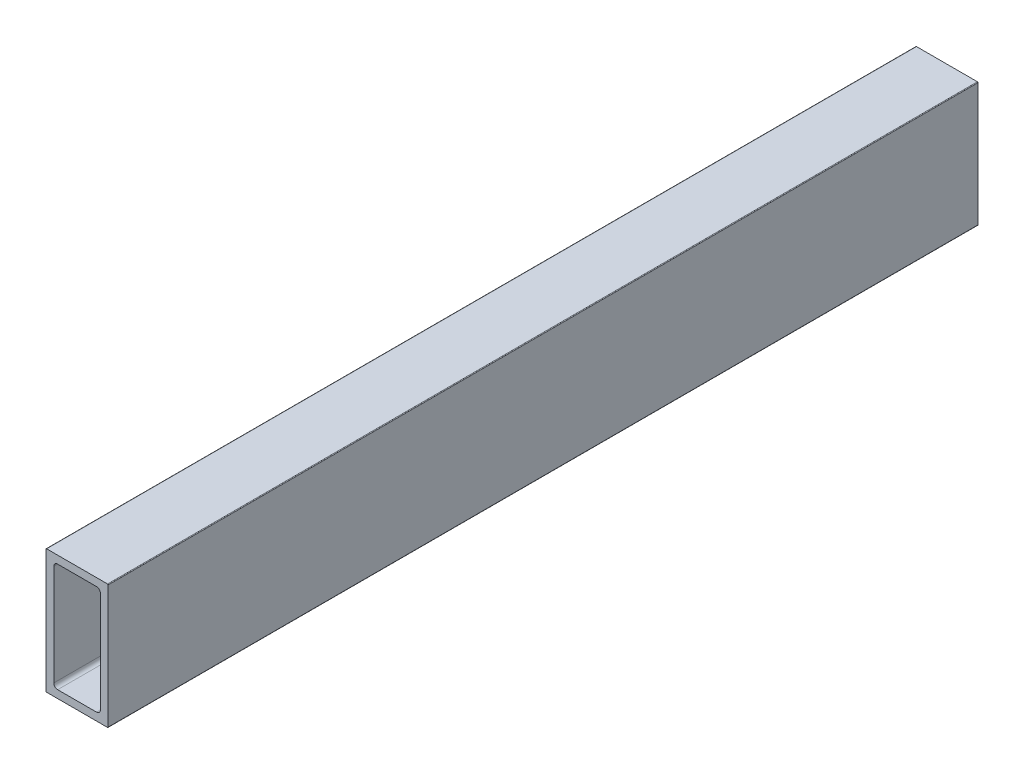
ISO-10303-21;
HEADER;
FILE_DESCRIPTION(('STEP AP214'),'2;1');
FILE_NAME('part.step','',(''),(''),'','','');
FILE_SCHEMA(('AUTOMOTIVE_DESIGN { 1 0 10303 214 1 1 1 1 }'));
ENDSEC;
DATA;
#1=APPLICATION_CONTEXT('core data for automotive mechanical design processes');
#2=APPLICATION_PROTOCOL_DEFINITION('international standard','automotive_design',2000,#1);
#3=PRODUCT_CONTEXT('',#1,'mechanical');
#4=PRODUCT('Part','Part','',(#3));
#5=PRODUCT_RELATED_PRODUCT_CATEGORY('part','',(#4));
#6=PRODUCT_DEFINITION_FORMATION('','',#4);
#7=PRODUCT_DEFINITION_CONTEXT('part definition',#1,'design');
#8=PRODUCT_DEFINITION('design','',#6,#7);
#9=PRODUCT_DEFINITION_SHAPE('','',#8);
#10=(LENGTH_UNIT() NAMED_UNIT(*) SI_UNIT(.MILLI.,.METRE.));
#11=(NAMED_UNIT(*) PLANE_ANGLE_UNIT() SI_UNIT($,.RADIAN.));
#12=(NAMED_UNIT(*) SI_UNIT($,.STERADIAN.) SOLID_ANGLE_UNIT());
#13=UNCERTAINTY_MEASURE_WITH_UNIT(LENGTH_MEASURE(1.E-05),#10,'distance_accuracy_value','');
#14=(GEOMETRIC_REPRESENTATION_CONTEXT(3) GLOBAL_UNCERTAINTY_ASSIGNED_CONTEXT((#13)) GLOBAL_UNIT_ASSIGNED_CONTEXT((#10,
#11,#12)) REPRESENTATION_CONTEXT('',''));
#15=CARTESIAN_POINT('',(0.,0.,0.));
#16=DIRECTION('',(0.,0.,1.));
#17=DIRECTION('',(1.,0.,0.));
#18=AXIS2_PLACEMENT_3D('',#15,#16,#17);
#19=CARTESIAN_POINT('',(3.175,4.7625,1828.8));
#20=DIRECTION('',(1.,0.,0.));
#21=DIRECTION('',(0.,1.,0.));
#22=AXIS2_PLACEMENT_3D('',#19,#20,#21);
#23=PLANE('',#22);
#24=DIRECTION('',(0.,-1.,0.));
#25=VECTOR('',#24,1.);
#26=CARTESIAN_POINT('',(3.175,4.7625,1473.2));
#27=LINE('',#26,#25);
#28=CARTESIAN_POINT('',(3.175,46.0375,1473.2));
#29=VERTEX_POINT('',#28);
#30=CARTESIAN_POINT('',(3.175,4.7625,1473.2));
#31=VERTEX_POINT('',#30);
#32=EDGE_CURVE('E59',#29,#31,#27,.T.);
#33=ORIENTED_EDGE('',*,*,#32,.F.);
#34=DIRECTION('',(0.,0.,-1.));
#35=VECTOR('',#34,1.);
#36=CARTESIAN_POINT('',(3.175,46.0375,1828.8));
#37=LINE('',#36,#35);
#38=CARTESIAN_POINT('',(3.175,46.0375,1828.8));
#39=VERTEX_POINT('',#38);
#40=EDGE_CURVE('E52',#39,#29,#37,.T.);
#41=ORIENTED_EDGE('',*,*,#40,.F.);
#42=DIRECTION('',(0.,-1.,0.));
#43=VECTOR('',#42,1.);
#44=CARTESIAN_POINT('',(3.175,4.7625,1828.8));
#45=LINE('',#44,#43);
#46=CARTESIAN_POINT('',(3.175,4.7625,1828.8));
#47=VERTEX_POINT('',#46);
#48=EDGE_CURVE('E235',#39,#47,#45,.T.);
#49=ORIENTED_EDGE('',*,*,#48,.T.);
#50=DIRECTION('',(0.,0.,-1.));
#51=VECTOR('',#50,1.);
#52=CARTESIAN_POINT('',(3.175,4.7625,1828.8));
#53=LINE('',#52,#51);
#54=EDGE_CURVE('E304',#47,#31,#53,.T.);
#55=ORIENTED_EDGE('',*,*,#54,.T.);
#56=EDGE_LOOP('',(#33,#41,#49,#55));
#57=FACE_BOUND('',#56,.T.);
#58=ADVANCED_FACE('F44',(#57),#23,.T.);
#59=CARTESIAN_POINT('',(4.7625,46.0375,1828.8));
#60=DIRECTION('',(0.,0.,-1.));
#61=DIRECTION('',(-1.,0.,0.));
#62=AXIS2_PLACEMENT_3D('',#59,#60,#61);
#63=CYLINDRICAL_SURFACE('',#62,1.5875);
#64=ORIENTED_EDGE('',*,*,#40,.T.);
#65=CARTESIAN_POINT('',(4.7625,46.0375,1473.2));
#66=DIRECTION('',(0.,0.,1.));
#67=DIRECTION('',(1.,0.,0.));
#68=AXIS2_PLACEMENT_3D('',#65,#66,#67);
#69=CIRCLE('',#68,1.5875);
#70=CARTESIAN_POINT('',(4.7625,47.625,1473.2));
#71=VERTEX_POINT('',#70);
#72=EDGE_CURVE('E350',#29,#71,#69,.F.);
#73=ORIENTED_EDGE('',*,*,#72,.T.);
#74=DIRECTION('',(0.,0.,-1.));
#75=VECTOR('',#74,1.);
#76=CARTESIAN_POINT('',(4.7625,47.625,1828.8));
#77=LINE('',#76,#75);
#78=CARTESIAN_POINT('',(4.7625,47.625,1828.8));
#79=VERTEX_POINT('',#78);
#80=EDGE_CURVE('E213',#79,#71,#77,.T.);
#81=ORIENTED_EDGE('',*,*,#80,.F.);
#82=CARTESIAN_POINT('',(4.7625,46.0375,1828.8));
#83=DIRECTION('',(0.,0.,1.));
#84=DIRECTION('',(-1.,0.,0.));
#85=AXIS2_PLACEMENT_3D('',#82,#83,#84);
#86=CIRCLE('',#85,1.5875);
#87=EDGE_CURVE('E239',#79,#39,#86,.T.);
#88=ORIENTED_EDGE('',*,*,#87,.T.);
#89=EDGE_LOOP('',(#64,#73,#81,#88));
#90=FACE_BOUND('',#89,.T.);
#91=ADVANCED_FACE('F353',(#90),#63,.F.);
#92=CARTESIAN_POINT('',(4.7625,47.625,1828.8));
#93=DIRECTION('',(0.,-1.,0.));
#94=DIRECTION('',(0.,0.,-1.));
#95=AXIS2_PLACEMENT_3D('',#92,#93,#94);
#96=PLANE('',#95);
#97=DIRECTION('',(-1.,0.,0.));
#98=VECTOR('',#97,1.);
#99=CARTESIAN_POINT('',(4.7625,47.625,1473.2));
#100=LINE('',#99,#98);
#101=CARTESIAN_POINT('',(20.6375,47.625,1473.2));
#102=VERTEX_POINT('',#101);
#103=EDGE_CURVE('E348',#102,#71,#100,.T.);
#104=ORIENTED_EDGE('',*,*,#103,.F.);
#105=DIRECTION('',(0.,0.,-1.));
#106=VECTOR('',#105,1.);
#107=CARTESIAN_POINT('',(20.6375,47.625,1828.8));
#108=LINE('',#107,#106);
#109=CARTESIAN_POINT('',(20.6375,47.625,1828.8));
#110=VERTEX_POINT('',#109);
#111=EDGE_CURVE('E210',#110,#102,#108,.T.);
#112=ORIENTED_EDGE('',*,*,#111,.F.);
#113=DIRECTION('',(-1.,0.,0.));
#114=VECTOR('',#113,1.);
#115=CARTESIAN_POINT('',(4.7625,47.625,1828.8));
#116=LINE('',#115,#114);
#117=EDGE_CURVE('E259',#110,#79,#116,.T.);
#118=ORIENTED_EDGE('',*,*,#117,.T.);
#119=ORIENTED_EDGE('',*,*,#80,.T.);
#120=EDGE_LOOP('',(#104,#112,#118,#119));
#121=FACE_BOUND('',#120,.T.);
#122=ADVANCED_FACE('F355',(#121),#96,.T.);
#123=CARTESIAN_POINT('',(20.6375,46.0375,1828.8));
#124=DIRECTION('',(0.,0.,-1.));
#125=DIRECTION('',(-1.,0.,0.));
#126=AXIS2_PLACEMENT_3D('',#123,#124,#125);
#127=CYLINDRICAL_SURFACE('',#126,1.5875);
#128=ORIENTED_EDGE('',*,*,#111,.T.);
#129=CARTESIAN_POINT('',(20.6375,46.0375,1473.2));
#130=DIRECTION('',(0.,0.,1.));
#131=DIRECTION('',(1.,0.,0.));
#132=AXIS2_PLACEMENT_3D('',#129,#130,#131);
#133=CIRCLE('',#132,1.5875);
#134=CARTESIAN_POINT('',(22.225,46.0375,1473.2));
#135=VERTEX_POINT('',#134);
#136=EDGE_CURVE('E345',#102,#135,#133,.F.);
#137=ORIENTED_EDGE('',*,*,#136,.T.);
#138=DIRECTION('',(0.,0.,-1.));
#139=VECTOR('',#138,1.);
#140=CARTESIAN_POINT('',(22.225,46.0375,1828.8));
#141=LINE('',#140,#139);
#142=CARTESIAN_POINT('',(22.225,46.0375,1828.8));
#143=VERTEX_POINT('',#142);
#144=EDGE_CURVE('E214',#143,#135,#141,.T.);
#145=ORIENTED_EDGE('',*,*,#144,.F.);
#146=CARTESIAN_POINT('',(20.6375,46.0375,1828.8));
#147=DIRECTION('',(0.,0.,1.));
#148=DIRECTION('',(-1.,0.,0.));
#149=AXIS2_PLACEMENT_3D('',#146,#147,#148);
#150=CIRCLE('',#149,1.5875);
#151=EDGE_CURVE('E256',#143,#110,#150,.T.);
#152=ORIENTED_EDGE('',*,*,#151,.T.);
#153=EDGE_LOOP('',(#128,#137,#145,#152));
#154=FACE_BOUND('',#153,.T.);
#155=ADVANCED_FACE('F356',(#154),#127,.F.);
#156=CARTESIAN_POINT('',(22.225,4.7625,1828.8));
#157=DIRECTION('',(-1.,0.,0.));
#158=DIRECTION('',(0.,0.,1.));
#159=AXIS2_PLACEMENT_3D('',#156,#157,#158);
#160=PLANE('',#159);
#161=DIRECTION('',(0.,1.,0.));
#162=VECTOR('',#161,1.);
#163=CARTESIAN_POINT('',(22.225,4.7625,1473.2));
#164=LINE('',#163,#162);
#165=CARTESIAN_POINT('',(22.225,4.7625,1473.2));
#166=VERTEX_POINT('',#165);
#167=EDGE_CURVE('E343',#166,#135,#164,.T.);
#168=ORIENTED_EDGE('',*,*,#167,.F.);
#169=DIRECTION('',(0.,0.,-1.));
#170=VECTOR('',#169,1.);
#171=CARTESIAN_POINT('',(22.225,4.7625,1828.8));
#172=LINE('',#171,#170);
#173=CARTESIAN_POINT('',(22.225,4.7625,1828.8));
#174=VERTEX_POINT('',#173);
#175=EDGE_CURVE('E295',#174,#166,#172,.T.);
#176=ORIENTED_EDGE('',*,*,#175,.F.);
#177=DIRECTION('',(0.,1.,0.));
#178=VECTOR('',#177,1.);
#179=CARTESIAN_POINT('',(22.225,4.7625,1828.8));
#180=LINE('',#179,#178);
#181=EDGE_CURVE('E252',#174,#143,#180,.T.);
#182=ORIENTED_EDGE('',*,*,#181,.T.);
#183=ORIENTED_EDGE('',*,*,#144,.T.);
#184=EDGE_LOOP('',(#168,#176,#182,#183));
#185=FACE_BOUND('',#184,.T.);
#186=ADVANCED_FACE('F359',(#185),#160,.T.);
#187=CARTESIAN_POINT('',(20.6375,4.7625,1828.8));
#188=DIRECTION('',(0.,0.,-1.));
#189=DIRECTION('',(-1.,0.,0.));
#190=AXIS2_PLACEMENT_3D('',#187,#188,#189);
#191=CYLINDRICAL_SURFACE('',#190,1.5875);
#192=ORIENTED_EDGE('',*,*,#175,.T.);
#193=CARTESIAN_POINT('',(20.6375,4.7625,1473.2));
#194=DIRECTION('',(0.,0.,1.));
#195=DIRECTION('',(1.,0.,0.));
#196=AXIS2_PLACEMENT_3D('',#193,#194,#195);
#197=CIRCLE('',#196,1.5875);
#198=CARTESIAN_POINT('',(20.6375,3.175,1473.2));
#199=VERTEX_POINT('',#198);
#200=EDGE_CURVE('E340',#166,#199,#197,.F.);
#201=ORIENTED_EDGE('',*,*,#200,.T.);
#202=DIRECTION('',(0.,0.,-1.));
#203=VECTOR('',#202,1.);
#204=CARTESIAN_POINT('',(20.6375,3.175,1828.8));
#205=LINE('',#204,#203);
#206=CARTESIAN_POINT('',(20.6375,3.175,1828.8));
#207=VERTEX_POINT('',#206);
#208=EDGE_CURVE('E208',#207,#199,#205,.T.);
#209=ORIENTED_EDGE('',*,*,#208,.F.);
#210=CARTESIAN_POINT('',(20.6375,4.7625,1828.8));
#211=DIRECTION('',(0.,0.,1.));
#212=DIRECTION('',(-1.,0.,0.));
#213=AXIS2_PLACEMENT_3D('',#210,#211,#212);
#214=CIRCLE('',#213,1.5875);
#215=EDGE_CURVE('E255',#207,#174,#214,.T.);
#216=ORIENTED_EDGE('',*,*,#215,.T.);
#217=EDGE_LOOP('',(#192,#201,#209,#216));
#218=FACE_BOUND('',#217,.T.);
#219=ADVANCED_FACE('F377',(#218),#191,.F.);
#220=CARTESIAN_POINT('',(4.7625,3.175,1828.8));
#221=DIRECTION('',(0.,1.,0.));
#222=DIRECTION('',(1.,0.,0.));
#223=AXIS2_PLACEMENT_3D('',#220,#221,#222);
#224=PLANE('',#223);
#225=DIRECTION('',(1.,0.,0.));
#226=VECTOR('',#225,1.);
#227=CARTESIAN_POINT('',(4.7625,3.175,1473.2));
#228=LINE('',#227,#226);
#229=CARTESIAN_POINT('',(4.7625,3.175,1473.2));
#230=VERTEX_POINT('',#229);
#231=EDGE_CURVE('E338',#230,#199,#228,.T.);
#232=ORIENTED_EDGE('',*,*,#231,.F.);
#233=DIRECTION('',(0.,0.,-1.));
#234=VECTOR('',#233,1.);
#235=CARTESIAN_POINT('',(4.7625,3.175,1828.8));
#236=LINE('',#235,#234);
#237=CARTESIAN_POINT('',(4.7625,3.175,1828.8));
#238=VERTEX_POINT('',#237);
#239=EDGE_CURVE('E313',#238,#230,#236,.T.);
#240=ORIENTED_EDGE('',*,*,#239,.F.);
#241=DIRECTION('',(1.,0.,0.));
#242=VECTOR('',#241,1.);
#243=CARTESIAN_POINT('',(4.7625,3.175,1828.8));
#244=LINE('',#243,#242);
#245=EDGE_CURVE('E248',#238,#207,#244,.T.);
#246=ORIENTED_EDGE('',*,*,#245,.T.);
#247=ORIENTED_EDGE('',*,*,#208,.T.);
#248=EDGE_LOOP('',(#232,#240,#246,#247));
#249=FACE_BOUND('',#248,.T.);
#250=ADVANCED_FACE('F374',(#249),#224,.T.);
#251=CARTESIAN_POINT('',(4.7625,4.7625,1828.8));
#252=DIRECTION('',(0.,0.,-1.));
#253=DIRECTION('',(-1.,0.,0.));
#254=AXIS2_PLACEMENT_3D('',#251,#252,#253);
#255=CYLINDRICAL_SURFACE('',#254,1.5875);
#256=ORIENTED_EDGE('',*,*,#239,.T.);
#257=CARTESIAN_POINT('',(4.7625,4.7625,1473.2));
#258=DIRECTION('',(0.,0.,1.));
#259=DIRECTION('',(1.,0.,0.));
#260=AXIS2_PLACEMENT_3D('',#257,#258,#259);
#261=CIRCLE('',#260,1.5875);
#262=EDGE_CURVE('E180',#230,#31,#261,.F.);
#263=ORIENTED_EDGE('',*,*,#262,.T.);
#264=ORIENTED_EDGE('',*,*,#54,.F.);
#265=CARTESIAN_POINT('',(4.7625,4.7625,1828.8));
#266=DIRECTION('',(0.,0.,1.));
#267=DIRECTION('',(1.,0.,0.));
#268=AXIS2_PLACEMENT_3D('',#265,#266,#267);
#269=CIRCLE('',#268,1.5875);
#270=EDGE_CURVE('E219',#47,#238,#269,.T.);
#271=ORIENTED_EDGE('',*,*,#270,.T.);
#272=EDGE_LOOP('',(#256,#263,#264,#271));
#273=FACE_BOUND('',#272,.T.);
#274=ADVANCED_FACE('F370',(#273),#255,.F.);
#275=CARTESIAN_POINT('',(0.,0.254,1828.8));
#276=DIRECTION('',(1.,0.,0.));
#277=DIRECTION('',(0.,1.,0.));
#278=AXIS2_PLACEMENT_3D('',#275,#276,#277);
#279=PLANE('',#278);
#280=DIRECTION('',(0.,0.,-1.));
#281=VECTOR('',#280,1.);
#282=CARTESIAN_POINT('',(0.,50.546,1828.8));
#283=LINE('',#282,#281);
#284=CARTESIAN_POINT('',(0.,50.546,1828.8));
#285=VERTEX_POINT('',#284);
#286=CARTESIAN_POINT('',(0.,50.546,1473.2));
#287=VERTEX_POINT('',#286);
#288=EDGE_CURVE('E223',#285,#287,#283,.T.);
#289=ORIENTED_EDGE('',*,*,#288,.T.);
#290=DIRECTION('',(0.,-1.,0.));
#291=VECTOR('',#290,1.);
#292=CARTESIAN_POINT('',(0.,0.254,1473.2));
#293=LINE('',#292,#291);
#294=CARTESIAN_POINT('',(0.,0.254,1473.2));
#295=VERTEX_POINT('',#294);
#296=EDGE_CURVE('E329',#287,#295,#293,.T.);
#297=ORIENTED_EDGE('',*,*,#296,.T.);
#298=DIRECTION('',(0.,0.,-1.));
#299=VECTOR('',#298,1.);
#300=CARTESIAN_POINT('',(0.,0.254,1828.8));
#301=LINE('',#300,#299);
#302=CARTESIAN_POINT('',(0.,0.254,1828.8));
#303=VERTEX_POINT('',#302);
#304=EDGE_CURVE('E230',#303,#295,#301,.T.);
#305=ORIENTED_EDGE('',*,*,#304,.F.);
#306=DIRECTION('',(0.,-1.,0.));
#307=VECTOR('',#306,1.);
#308=CARTESIAN_POINT('',(0.,0.254,1828.8));
#309=LINE('',#308,#307);
#310=EDGE_CURVE('E215',#285,#303,#309,.T.);
#311=ORIENTED_EDGE('',*,*,#310,.F.);
#312=EDGE_LOOP('',(#289,#297,#305,#311));
#313=FACE_BOUND('',#312,.T.);
#314=ADVANCED_FACE('F46',(#313),#279,.F.);
#315=CARTESIAN_POINT('',(0.254,50.546,1828.8));
#316=DIRECTION('',(0.,0.,-1.));
#317=DIRECTION('',(-1.,0.,0.));
#318=AXIS2_PLACEMENT_3D('',#315,#316,#317);
#319=CYLINDRICAL_SURFACE('',#318,0.253999999999995);
#320=CARTESIAN_POINT('',(0.254,50.546,1473.2));
#321=DIRECTION('',(0.,0.,1.));
#322=DIRECTION('',(1.,0.,0.));
#323=AXIS2_PLACEMENT_3D('',#320,#321,#322);
#324=CIRCLE('',#323,0.253999999999995);
#325=CARTESIAN_POINT('',(0.254,50.8,1473.2));
#326=VERTEX_POINT('',#325);
#327=EDGE_CURVE('E334',#287,#326,#324,.F.);
#328=ORIENTED_EDGE('',*,*,#327,.F.);
#329=ORIENTED_EDGE('',*,*,#288,.F.);
#330=CARTESIAN_POINT('',(0.254,50.546,1828.8));
#331=DIRECTION('',(0.,0.,1.));
#332=DIRECTION('',(-1.,0.,0.));
#333=AXIS2_PLACEMENT_3D('',#330,#331,#332);
#334=CIRCLE('',#333,0.253999999999995);
#335=CARTESIAN_POINT('',(0.254,50.8,1828.8));
#336=VERTEX_POINT('',#335);
#337=EDGE_CURVE('E220',#336,#285,#334,.T.);
#338=ORIENTED_EDGE('',*,*,#337,.F.);
#339=DIRECTION('',(0.,0.,-1.));
#340=VECTOR('',#339,1.);
#341=CARTESIAN_POINT('',(0.254,50.8,1828.8));
#342=LINE('',#341,#340);
#343=EDGE_CURVE('E201',#336,#326,#342,.T.);
#344=ORIENTED_EDGE('',*,*,#343,.T.);
#345=EDGE_LOOP('',(#328,#329,#338,#344));
#346=FACE_BOUND('',#345,.T.);
#347=ADVANCED_FACE('F410',(#346),#319,.T.);
#348=CARTESIAN_POINT('',(0.254,50.8,1828.8));
#349=DIRECTION('',(0.,-1.,0.));
#350=DIRECTION('',(0.,0.,-1.));
#351=AXIS2_PLACEMENT_3D('',#348,#349,#350);
#352=PLANE('',#351);
#353=DIRECTION('',(0.,0.,-1.));
#354=VECTOR('',#353,1.);
#355=CARTESIAN_POINT('',(25.146,50.8,1828.8));
#356=LINE('',#355,#354);
#357=CARTESIAN_POINT('',(25.146,50.8,1828.8));
#358=VERTEX_POINT('',#357);
#359=CARTESIAN_POINT('',(25.146,50.8,1473.2));
#360=VERTEX_POINT('',#359);
#361=EDGE_CURVE('E195',#358,#360,#356,.T.);
#362=ORIENTED_EDGE('',*,*,#361,.T.);
#363=DIRECTION('',(-1.,0.,0.));
#364=VECTOR('',#363,1.);
#365=CARTESIAN_POINT('',(0.254,50.8,1473.2));
#366=LINE('',#365,#364);
#367=EDGE_CURVE('E176',#360,#326,#366,.T.);
#368=ORIENTED_EDGE('',*,*,#367,.T.);
#369=ORIENTED_EDGE('',*,*,#343,.F.);
#370=DIRECTION('',(-1.,0.,0.));
#371=VECTOR('',#370,1.);
#372=CARTESIAN_POINT('',(0.254,50.8,1828.8));
#373=LINE('',#372,#371);
#374=EDGE_CURVE('E280',#358,#336,#373,.T.);
#375=ORIENTED_EDGE('',*,*,#374,.F.);
#376=EDGE_LOOP('',(#362,#368,#369,#375));
#377=FACE_BOUND('',#376,.T.);
#378=ADVANCED_FACE('F407',(#377),#352,.F.);
#379=CARTESIAN_POINT('',(25.146,50.546,1828.8));
#380=DIRECTION('',(0.,0.,-1.));
#381=DIRECTION('',(-1.,0.,0.));
#382=AXIS2_PLACEMENT_3D('',#379,#380,#381);
#383=CYLINDRICAL_SURFACE('',#382,0.253999999999994);
#384=CARTESIAN_POINT('',(25.146,50.546,1473.2));
#385=DIRECTION('',(0.,0.,1.));
#386=DIRECTION('',(1.,0.,0.));
#387=AXIS2_PLACEMENT_3D('',#384,#385,#386);
#388=CIRCLE('',#387,0.253999999999994);
#389=CARTESIAN_POINT('',(25.4,50.546,1473.2));
#390=VERTEX_POINT('',#389);
#391=EDGE_CURVE('E170',#360,#390,#388,.F.);
#392=ORIENTED_EDGE('',*,*,#391,.F.);
#393=ORIENTED_EDGE('',*,*,#361,.F.);
#394=CARTESIAN_POINT('',(25.146,50.546,1828.8));
#395=DIRECTION('',(0.,0.,1.));
#396=DIRECTION('',(-1.,0.,0.));
#397=AXIS2_PLACEMENT_3D('',#394,#395,#396);
#398=CIRCLE('',#397,0.253999999999994);
#399=CARTESIAN_POINT('',(25.4,50.546,1828.8));
#400=VERTEX_POINT('',#399);
#401=EDGE_CURVE('E192',#400,#358,#398,.T.);
#402=ORIENTED_EDGE('',*,*,#401,.F.);
#403=DIRECTION('',(0.,0.,-1.));
#404=VECTOR('',#403,1.);
#405=CARTESIAN_POINT('',(25.4,50.546,1828.8));
#406=LINE('',#405,#404);
#407=EDGE_CURVE('E186',#400,#390,#406,.T.);
#408=ORIENTED_EDGE('',*,*,#407,.T.);
#409=EDGE_LOOP('',(#392,#393,#402,#408));
#410=FACE_BOUND('',#409,.T.);
#411=ADVANCED_FACE('F190',(#410),#383,.T.);
#412=CARTESIAN_POINT('',(25.4,0.254,1828.8));
#413=DIRECTION('',(-1.,0.,0.));
#414=DIRECTION('',(0.,0.,1.));
#415=AXIS2_PLACEMENT_3D('',#412,#413,#414);
#416=PLANE('',#415);
#417=DIRECTION('',(0.,0.,-1.));
#418=VECTOR('',#417,1.);
#419=CARTESIAN_POINT('',(25.4,0.254,1828.8));
#420=LINE('',#419,#418);
#421=CARTESIAN_POINT('',(25.4,0.254,1828.8));
#422=VERTEX_POINT('',#421);
#423=CARTESIAN_POINT('',(25.4,0.254,1473.2));
#424=VERTEX_POINT('',#423);
#425=EDGE_CURVE('E188',#422,#424,#420,.T.);
#426=ORIENTED_EDGE('',*,*,#425,.T.);
#427=DIRECTION('',(0.,-1.,0.));
#428=VECTOR('',#427,1.);
#429=CARTESIAN_POINT('',(25.4,0.,1473.2));
#430=LINE('',#429,#428);
#431=EDGE_CURVE('E173',#390,#424,#430,.T.);
#432=ORIENTED_EDGE('',*,*,#431,.F.);
#433=ORIENTED_EDGE('',*,*,#407,.F.);
#434=DIRECTION('',(0.,1.,0.));
#435=VECTOR('',#434,1.);
#436=CARTESIAN_POINT('',(25.4,0.254,1828.8));
#437=LINE('',#436,#435);
#438=EDGE_CURVE('E244',#422,#400,#437,.T.);
#439=ORIENTED_EDGE('',*,*,#438,.F.);
#440=EDGE_LOOP('',(#426,#432,#433,#439));
#441=FACE_BOUND('',#440,.T.);
#442=ADVANCED_FACE('F184',(#441),#416,.F.);
#443=CARTESIAN_POINT('',(25.146,0.254,1828.8));
#444=DIRECTION('',(0.,0.,-1.));
#445=DIRECTION('',(-1.,0.,0.));
#446=AXIS2_PLACEMENT_3D('',#443,#444,#445);
#447=CYLINDRICAL_SURFACE('',#446,0.254);
#448=CARTESIAN_POINT('',(25.146,0.254,1473.2));
#449=DIRECTION('',(0.,0.,1.));
#450=DIRECTION('',(1.,0.,0.));
#451=AXIS2_PLACEMENT_3D('',#448,#449,#450);
#452=CIRCLE('',#451,0.254);
#453=CARTESIAN_POINT('',(25.146,0.,1473.2));
#454=VERTEX_POINT('',#453);
#455=EDGE_CURVE('E324',#424,#454,#452,.F.);
#456=ORIENTED_EDGE('',*,*,#455,.F.);
#457=ORIENTED_EDGE('',*,*,#425,.F.);
#458=CARTESIAN_POINT('',(25.146,0.254,1828.8));
#459=DIRECTION('',(0.,0.,1.));
#460=DIRECTION('',(1.,0.,0.));
#461=AXIS2_PLACEMENT_3D('',#458,#459,#460);
#462=CIRCLE('',#461,0.254);
#463=CARTESIAN_POINT('',(25.146,0.,1828.8));
#464=VERTEX_POINT('',#463);
#465=EDGE_CURVE('E240',#464,#422,#462,.T.);
#466=ORIENTED_EDGE('',*,*,#465,.F.);
#467=DIRECTION('',(0.,0.,-1.));
#468=VECTOR('',#467,1.);
#469=CARTESIAN_POINT('',(25.146,0.,1828.8));
#470=LINE('',#469,#468);
#471=EDGE_CURVE('E204',#464,#454,#470,.T.);
#472=ORIENTED_EDGE('',*,*,#471,.T.);
#473=EDGE_LOOP('',(#456,#457,#466,#472));
#474=FACE_BOUND('',#473,.T.);
#475=ADVANCED_FACE('F323',(#474),#447,.T.);
#476=CARTESIAN_POINT('',(0.254,0.,1828.8));
#477=DIRECTION('',(0.,1.,0.));
#478=DIRECTION('',(1.,0.,0.));
#479=AXIS2_PLACEMENT_3D('',#476,#477,#478);
#480=PLANE('',#479);
#481=DIRECTION('',(0.,0.,-1.));
#482=VECTOR('',#481,1.);
#483=CARTESIAN_POINT('',(0.254,0.,1828.8));
#484=LINE('',#483,#482);
#485=CARTESIAN_POINT('',(0.254,0.,1828.8));
#486=VERTEX_POINT('',#485);
#487=CARTESIAN_POINT('',(0.254,0.,1473.2));
#488=VERTEX_POINT('',#487);
#489=EDGE_CURVE('E234',#486,#488,#484,.T.);
#490=ORIENTED_EDGE('',*,*,#489,.T.);
#491=DIRECTION('',(1.,0.,0.));
#492=VECTOR('',#491,1.);
#493=CARTESIAN_POINT('',(0.254,0.,1473.2));
#494=LINE('',#493,#492);
#495=EDGE_CURVE('E66',#488,#454,#494,.T.);
#496=ORIENTED_EDGE('',*,*,#495,.T.);
#497=ORIENTED_EDGE('',*,*,#471,.F.);
#498=DIRECTION('',(1.,0.,0.));
#499=VECTOR('',#498,1.);
#500=CARTESIAN_POINT('',(0.254,0.,1828.8));
#501=LINE('',#500,#499);
#502=EDGE_CURVE('E229',#486,#464,#501,.T.);
#503=ORIENTED_EDGE('',*,*,#502,.F.);
#504=EDGE_LOOP('',(#490,#496,#497,#503));
#505=FACE_BOUND('',#504,.T.);
#506=ADVANCED_FACE('F327',(#505),#480,.F.);
#507=CARTESIAN_POINT('',(0.254,0.254,1828.8));
#508=DIRECTION('',(0.,0.,-1.));
#509=DIRECTION('',(-1.,0.,0.));
#510=AXIS2_PLACEMENT_3D('',#507,#508,#509);
#511=CYLINDRICAL_SURFACE('',#510,0.254);
#512=CARTESIAN_POINT('',(0.254,0.254,1473.2));
#513=DIRECTION('',(0.,0.,1.));
#514=DIRECTION('',(1.,0.,0.));
#515=AXIS2_PLACEMENT_3D('',#512,#513,#514);
#516=CIRCLE('',#515,0.254);
#517=EDGE_CURVE('E11',#488,#295,#516,.F.);
#518=ORIENTED_EDGE('',*,*,#517,.F.);
#519=ORIENTED_EDGE('',*,*,#489,.F.);
#520=CARTESIAN_POINT('',(0.254,0.254,1828.8));
#521=DIRECTION('',(0.,0.,1.));
#522=DIRECTION('',(-1.,0.,0.));
#523=AXIS2_PLACEMENT_3D('',#520,#521,#522);
#524=CIRCLE('',#523,0.254);
#525=EDGE_CURVE('E225',#303,#486,#524,.T.);
#526=ORIENTED_EDGE('',*,*,#525,.F.);
#527=ORIENTED_EDGE('',*,*,#304,.T.);
#528=EDGE_LOOP('',(#518,#519,#526,#527));
#529=FACE_BOUND('',#528,.T.);
#530=ADVANCED_FACE('F397',(#529),#511,.T.);
#531=CARTESIAN_POINT('',(0.254,0.254,1828.8));
#532=DIRECTION('',(0.,0.,-1.));
#533=DIRECTION('',(0.,-1.,0.));
#534=AXIS2_PLACEMENT_3D('',#531,#532,#533);
#535=PLANE('',#534);
#536=ORIENTED_EDGE('',*,*,#270,.F.);
#537=ORIENTED_EDGE('',*,*,#48,.F.);
#538=ORIENTED_EDGE('',*,*,#87,.F.);
#539=ORIENTED_EDGE('',*,*,#117,.F.);
#540=ORIENTED_EDGE('',*,*,#151,.F.);
#541=ORIENTED_EDGE('',*,*,#181,.F.);
#542=ORIENTED_EDGE('',*,*,#215,.F.);
#543=ORIENTED_EDGE('',*,*,#245,.F.);
#544=EDGE_LOOP('',(#536,#537,#538,#539,#540,#541,#542,#543));
#545=FACE_BOUND('',#544,.T.);
#546=ORIENTED_EDGE('',*,*,#525,.T.);
#547=ORIENTED_EDGE('',*,*,#502,.T.);
#548=ORIENTED_EDGE('',*,*,#465,.T.);
#549=ORIENTED_EDGE('',*,*,#438,.T.);
#550=ORIENTED_EDGE('',*,*,#401,.T.);
#551=ORIENTED_EDGE('',*,*,#374,.T.);
#552=ORIENTED_EDGE('',*,*,#337,.T.);
#553=ORIENTED_EDGE('',*,*,#310,.T.);
#554=EDGE_LOOP('',(#546,#547,#548,#549,#550,#551,#552,#553));
#555=FACE_BOUND('',#554,.T.);
#556=ADVANCED_FACE('F364',(#545,#555),#535,.F.);
#557=CARTESIAN_POINT('',(-352.044,0.,1473.2));
#558=DIRECTION('',(0.,0.,1.));
#559=DIRECTION('',(1.,0.,0.));
#560=AXIS2_PLACEMENT_3D('',#557,#558,#559);
#561=PLANE('',#560);
#562=ORIENTED_EDGE('',*,*,#32,.T.);
#563=ORIENTED_EDGE('',*,*,#262,.F.);
#564=ORIENTED_EDGE('',*,*,#231,.T.);
#565=ORIENTED_EDGE('',*,*,#200,.F.);
#566=ORIENTED_EDGE('',*,*,#167,.T.);
#567=ORIENTED_EDGE('',*,*,#136,.F.);
#568=ORIENTED_EDGE('',*,*,#103,.T.);
#569=ORIENTED_EDGE('',*,*,#72,.F.);
#570=EDGE_LOOP('',(#562,#563,#564,#565,#566,#567,#568,#569));
#571=FACE_BOUND('',#570,.T.);
#572=ORIENTED_EDGE('',*,*,#391,.T.);
#573=ORIENTED_EDGE('',*,*,#431,.T.);
#574=ORIENTED_EDGE('',*,*,#455,.T.);
#575=ORIENTED_EDGE('',*,*,#495,.F.);
#576=ORIENTED_EDGE('',*,*,#517,.T.);
#577=ORIENTED_EDGE('',*,*,#296,.F.);
#578=ORIENTED_EDGE('',*,*,#327,.T.);
#579=ORIENTED_EDGE('',*,*,#367,.F.);
#580=EDGE_LOOP('',(#572,#573,#574,#575,#576,#577,#578,#579));
#581=FACE_BOUND('',#580,.T.);
#582=ADVANCED_FACE('F172',(#571,#581),#561,.F.);
#583=CLOSED_SHELL('',(#58,#91,#122,#155,#186,#219,#250,#274,#314,#347,#378,#411,#442,#475,#506,
#530,#556,#582));
#584=MANIFOLD_SOLID_BREP('B2',#583);
#585=ADVANCED_BREP_SHAPE_REPRESENTATION('',(#18,#584),#14);
#586=SHAPE_DEFINITION_REPRESENTATION(#9,#585);
ENDSEC;
END-ISO-10303-21;
